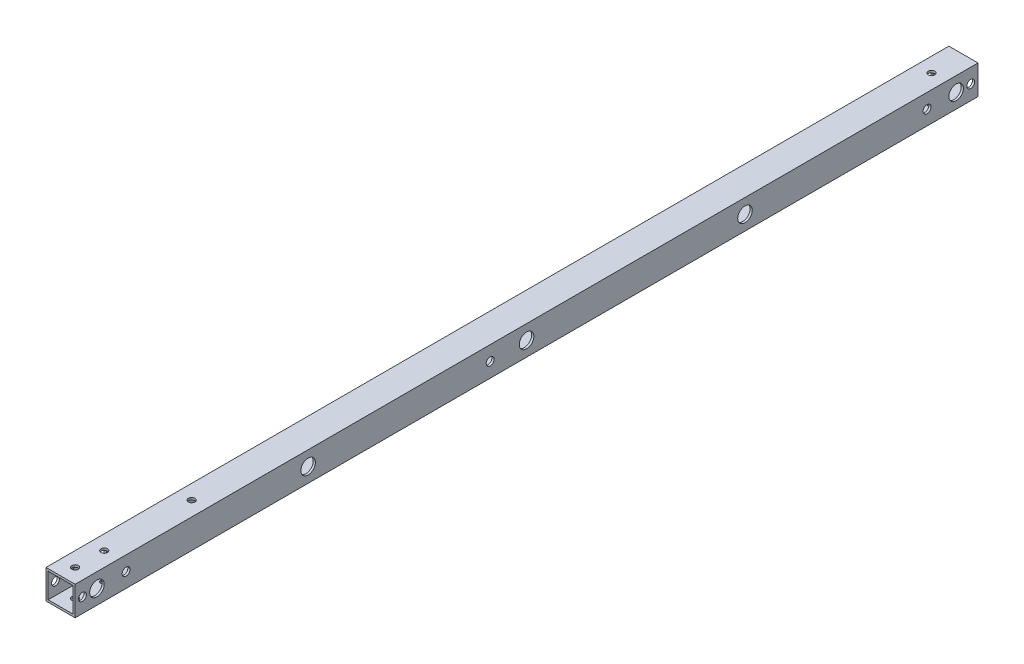
ISO-10303-21;
HEADER;
FILE_DESCRIPTION(('STEP AP214'),'2;1');
FILE_NAME('part.step','',(''),(''),'','','');
FILE_SCHEMA(('AUTOMOTIVE_DESIGN { 1 0 10303 214 1 1 1 1 }'));
ENDSEC;
DATA;
#1=APPLICATION_CONTEXT('core data for automotive mechanical design processes');
#2=APPLICATION_PROTOCOL_DEFINITION('international standard','automotive_design',2000,#1);
#3=PRODUCT_CONTEXT('',#1,'mechanical');
#4=PRODUCT('Part','Part','',(#3));
#5=PRODUCT_RELATED_PRODUCT_CATEGORY('part','',(#4));
#6=PRODUCT_DEFINITION_FORMATION('','',#4);
#7=PRODUCT_DEFINITION_CONTEXT('part definition',#1,'design');
#8=PRODUCT_DEFINITION('design','',#6,#7);
#9=PRODUCT_DEFINITION_SHAPE('','',#8);
#10=(LENGTH_UNIT() NAMED_UNIT(*) SI_UNIT(.MILLI.,.METRE.));
#11=(NAMED_UNIT(*) PLANE_ANGLE_UNIT() SI_UNIT($,.RADIAN.));
#12=(NAMED_UNIT(*) SI_UNIT($,.STERADIAN.) SOLID_ANGLE_UNIT());
#13=UNCERTAINTY_MEASURE_WITH_UNIT(LENGTH_MEASURE(1.E-05),#10,'distance_accuracy_value','');
#14=(GEOMETRIC_REPRESENTATION_CONTEXT(3) GLOBAL_UNCERTAINTY_ASSIGNED_CONTEXT((#13)) GLOBAL_UNIT_ASSIGNED_CONTEXT((#10,
#11,#12)) REPRESENTATION_CONTEXT('',''));
#15=CARTESIAN_POINT('',(0.,0.,0.));
#16=DIRECTION('',(0.,0.,1.));
#17=DIRECTION('',(1.,0.,0.));
#18=AXIS2_PLACEMENT_3D('',#15,#16,#17);
#19=CARTESIAN_POINT('',(0.,0.,620.));
#20=DIRECTION('',(0.,0.,-1.));
#21=DIRECTION('',(-1.,0.,0.));
#22=AXIS2_PLACEMENT_3D('',#19,#20,#21);
#23=PLANE('',#22);
#24=DIRECTION('',(0.,1.,0.));
#25=VECTOR('',#24,1.);
#26=CARTESIAN_POINT('',(10.,-10.,620.));
#27=LINE('',#26,#25);
#28=CARTESIAN_POINT('',(10.,-10.,620.));
#29=VERTEX_POINT('',#28);
#30=CARTESIAN_POINT('',(10.,10.,620.));
#31=VERTEX_POINT('',#30);
#32=EDGE_CURVE('E162',#29,#31,#27,.T.);
#33=ORIENTED_EDGE('',*,*,#32,.T.);
#34=DIRECTION('',(-1.,0.,0.));
#35=VECTOR('',#34,1.);
#36=CARTESIAN_POINT('',(-10.,10.,620.));
#37=LINE('',#36,#35);
#38=CARTESIAN_POINT('',(-10.,10.,620.));
#39=VERTEX_POINT('',#38);
#40=EDGE_CURVE('E166',#31,#39,#37,.T.);
#41=ORIENTED_EDGE('',*,*,#40,.T.);
#42=DIRECTION('',(0.,-1.,0.));
#43=VECTOR('',#42,1.);
#44=CARTESIAN_POINT('',(-10.,-10.,620.));
#45=LINE('',#44,#43);
#46=CARTESIAN_POINT('',(-10.,-10.,620.));
#47=VERTEX_POINT('',#46);
#48=EDGE_CURVE('E170',#39,#47,#45,.T.);
#49=ORIENTED_EDGE('',*,*,#48,.T.);
#50=DIRECTION('',(1.,0.,0.));
#51=VECTOR('',#50,1.);
#52=CARTESIAN_POINT('',(-10.,-10.,620.));
#53=LINE('',#52,#51);
#54=EDGE_CURVE('E173',#47,#29,#53,.T.);
#55=ORIENTED_EDGE('',*,*,#54,.T.);
#56=EDGE_LOOP('',(#33,#41,#49,#55));
#57=FACE_BOUND('',#56,.T.);
#58=DIRECTION('',(0.,1.,0.));
#59=VECTOR('',#58,1.);
#60=CARTESIAN_POINT('',(8.5,-8.5,620.));
#61=LINE('',#60,#59);
#62=CARTESIAN_POINT('',(8.5,-8.5,620.));
#63=VERTEX_POINT('',#62);
#64=CARTESIAN_POINT('',(8.5,8.5,620.));
#65=VERTEX_POINT('',#64);
#66=EDGE_CURVE('E111',#63,#65,#61,.T.);
#67=ORIENTED_EDGE('',*,*,#66,.F.);
#68=DIRECTION('',(1.,0.,0.));
#69=VECTOR('',#68,1.);
#70=CARTESIAN_POINT('',(-8.5,-8.5,620.));
#71=LINE('',#70,#69);
#72=CARTESIAN_POINT('',(-8.5,-8.5,620.));
#73=VERTEX_POINT('',#72);
#74=EDGE_CURVE('E138',#73,#63,#71,.T.);
#75=ORIENTED_EDGE('',*,*,#74,.F.);
#76=DIRECTION('',(0.,-1.,0.));
#77=VECTOR('',#76,1.);
#78=CARTESIAN_POINT('',(-8.5,-8.5,620.));
#79=LINE('',#78,#77);
#80=CARTESIAN_POINT('',(-8.5,8.5,620.));
#81=VERTEX_POINT('',#80);
#82=EDGE_CURVE('E133',#81,#73,#79,.T.);
#83=ORIENTED_EDGE('',*,*,#82,.F.);
#84=DIRECTION('',(-1.,0.,0.));
#85=VECTOR('',#84,1.);
#86=CARTESIAN_POINT('',(-8.5,8.5,620.));
#87=LINE('',#86,#85);
#88=EDGE_CURVE('E120',#65,#81,#87,.T.);
#89=ORIENTED_EDGE('',*,*,#88,.F.);
#90=EDGE_LOOP('',(#67,#75,#83,#89));
#91=FACE_BOUND('',#90,.T.);
#92=ADVANCED_FACE('F43',(#57,#91),#23,.F.);
#93=CARTESIAN_POINT('',(0.,0.,0.));
#94=DIRECTION('',(0.,0.,-1.));
#95=DIRECTION('',(-1.,0.,0.));
#96=AXIS2_PLACEMENT_3D('',#93,#94,#95);
#97=PLANE('',#96);
#98=DIRECTION('',(0.,1.,0.));
#99=VECTOR('',#98,1.);
#100=CARTESIAN_POINT('',(10.,-10.,0.));
#101=LINE('',#100,#99);
#102=CARTESIAN_POINT('',(10.,-10.,0.));
#103=VERTEX_POINT('',#102);
#104=CARTESIAN_POINT('',(10.,10.,0.));
#105=VERTEX_POINT('',#104);
#106=EDGE_CURVE('E129',#103,#105,#101,.T.);
#107=ORIENTED_EDGE('',*,*,#106,.F.);
#108=DIRECTION('',(1.,0.,0.));
#109=VECTOR('',#108,1.);
#110=CARTESIAN_POINT('',(-10.,-10.,0.));
#111=LINE('',#110,#109);
#112=CARTESIAN_POINT('',(-10.,-10.,0.));
#113=VERTEX_POINT('',#112);
#114=EDGE_CURVE('E167',#113,#103,#111,.T.);
#115=ORIENTED_EDGE('',*,*,#114,.F.);
#116=DIRECTION('',(0.,-1.,0.));
#117=VECTOR('',#116,1.);
#118=CARTESIAN_POINT('',(-10.,-10.,0.));
#119=LINE('',#118,#117);
#120=CARTESIAN_POINT('',(-10.,10.,0.));
#121=VERTEX_POINT('',#120);
#122=EDGE_CURVE('E183',#121,#113,#119,.T.);
#123=ORIENTED_EDGE('',*,*,#122,.F.);
#124=DIRECTION('',(-1.,0.,0.));
#125=VECTOR('',#124,1.);
#126=CARTESIAN_POINT('',(-10.,10.,0.));
#127=LINE('',#126,#125);
#128=EDGE_CURVE('E180',#105,#121,#127,.T.);
#129=ORIENTED_EDGE('',*,*,#128,.F.);
#130=EDGE_LOOP('',(#107,#115,#123,#129));
#131=FACE_BOUND('',#130,.T.);
#132=DIRECTION('',(1.,0.,0.));
#133=VECTOR('',#132,1.);
#134=CARTESIAN_POINT('',(-8.5,-8.5,0.));
#135=LINE('',#134,#133);
#136=CARTESIAN_POINT('',(-8.5,-8.5,0.));
#137=VERTEX_POINT('',#136);
#138=CARTESIAN_POINT('',(8.5,-8.5,0.));
#139=VERTEX_POINT('',#138);
#140=EDGE_CURVE('E121',#137,#139,#135,.T.);
#141=ORIENTED_EDGE('',*,*,#140,.T.);
#142=DIRECTION('',(0.,1.,0.));
#143=VECTOR('',#142,1.);
#144=CARTESIAN_POINT('',(8.5,-8.5,0.));
#145=LINE('',#144,#143);
#146=CARTESIAN_POINT('',(8.5,8.5,0.));
#147=VERTEX_POINT('',#146);
#148=EDGE_CURVE('E69',#139,#147,#145,.T.);
#149=ORIENTED_EDGE('',*,*,#148,.T.);
#150=DIRECTION('',(-1.,0.,0.));
#151=VECTOR('',#150,1.);
#152=CARTESIAN_POINT('',(-8.5,8.5,0.));
#153=LINE('',#152,#151);
#154=CARTESIAN_POINT('',(-8.5,8.5,0.));
#155=VERTEX_POINT('',#154);
#156=EDGE_CURVE('E127',#147,#155,#153,.T.);
#157=ORIENTED_EDGE('',*,*,#156,.T.);
#158=DIRECTION('',(0.,-1.,0.));
#159=VECTOR('',#158,1.);
#160=CARTESIAN_POINT('',(-8.5,-8.5,0.));
#161=LINE('',#160,#159);
#162=EDGE_CURVE('E149',#155,#137,#161,.T.);
#163=ORIENTED_EDGE('',*,*,#162,.T.);
#164=EDGE_LOOP('',(#141,#149,#157,#163));
#165=FACE_BOUND('',#164,.T.);
#166=ADVANCED_FACE('F393',(#131,#165),#97,.T.);
#167=CARTESIAN_POINT('',(10.,-10.,620.));
#168=DIRECTION('',(-1.,0.,0.));
#169=DIRECTION('',(0.,0.,1.));
#170=AXIS2_PLACEMENT_3D('',#167,#168,#169);
#171=PLANE('',#170);
#172=CARTESIAN_POINT('',(10.,0.,460.));
#173=DIRECTION('',(1.,0.,0.));
#174=DIRECTION('',(0.,0.,-1.));
#175=AXIS2_PLACEMENT_3D('',#172,#173,#174);
#176=CIRCLE('',#175,4.99999999999999);
#177=CARTESIAN_POINT('',(10.,0.,455.));
#178=VERTEX_POINT('',#177);
#179=EDGE_CURVE('E537',#178,#178,#176,.T.);
#180=ORIENTED_EDGE('',*,*,#179,.F.);
#181=EDGE_LOOP('',(#180));
#182=FACE_BOUND('',#181,.T.);
#183=CARTESIAN_POINT('',(10.,0.,310.));
#184=DIRECTION('',(1.,0.,0.));
#185=DIRECTION('',(0.,0.,-1.));
#186=AXIS2_PLACEMENT_3D('',#183,#184,#185);
#187=CIRCLE('',#186,4.99999999999999);
#188=CARTESIAN_POINT('',(10.,0.,305.));
#189=VERTEX_POINT('',#188);
#190=EDGE_CURVE('E542',#189,#189,#187,.T.);
#191=ORIENTED_EDGE('',*,*,#190,.F.);
#192=EDGE_LOOP('',(#191));
#193=FACE_BOUND('',#192,.T.);
#194=CARTESIAN_POINT('',(10.,0.,160.));
#195=DIRECTION('',(1.,0.,0.));
#196=DIRECTION('',(0.,0.,-1.));
#197=AXIS2_PLACEMENT_3D('',#194,#195,#196);
#198=CIRCLE('',#197,4.99999999999999);
#199=CARTESIAN_POINT('',(10.,0.,155.));
#200=VERTEX_POINT('',#199);
#201=EDGE_CURVE('E552',#200,#200,#198,.T.);
#202=ORIENTED_EDGE('',*,*,#201,.F.);
#203=EDGE_LOOP('',(#202));
#204=FACE_BOUND('',#203,.T.);
#205=CARTESIAN_POINT('',(10.,0.,605.));
#206=DIRECTION('',(1.,0.,0.));
#207=DIRECTION('',(0.,0.,-1.));
#208=AXIS2_PLACEMENT_3D('',#205,#206,#207);
#209=CIRCLE('',#208,5.00000000000004);
#210=CARTESIAN_POINT('',(10.,0.,600.));
#211=VERTEX_POINT('',#210);
#212=EDGE_CURVE('E261',#211,#211,#209,.T.);
#213=ORIENTED_EDGE('',*,*,#212,.F.);
#214=EDGE_LOOP('',(#213));
#215=FACE_BOUND('',#214,.T.);
#216=CARTESIAN_POINT('',(10.,0.,15.));
#217=DIRECTION('',(1.,0.,0.));
#218=DIRECTION('',(0.,0.,-1.));
#219=AXIS2_PLACEMENT_3D('',#216,#217,#218);
#220=CIRCLE('',#219,5.);
#221=CARTESIAN_POINT('',(10.,0.,10.));
#222=VERTEX_POINT('',#221);
#223=EDGE_CURVE('E583',#222,#222,#220,.T.);
#224=ORIENTED_EDGE('',*,*,#223,.F.);
#225=EDGE_LOOP('',(#224));
#226=FACE_BOUND('',#225,.T.);
#227=CARTESIAN_POINT('',(10.,0.,5.));
#228=DIRECTION('',(1.,0.,0.));
#229=DIRECTION('',(0.,0.,-1.));
#230=AXIS2_PLACEMENT_3D('',#227,#228,#229);
#231=CIRCLE('',#230,2.7);
#232=CARTESIAN_POINT('',(10.,0.,2.3));
#233=VERTEX_POINT('',#232);
#234=EDGE_CURVE('E221',#233,#233,#231,.T.);
#235=ORIENTED_EDGE('',*,*,#234,.F.);
#236=EDGE_LOOP('',(#235));
#237=FACE_BOUND('',#236,.T.);
#238=CARTESIAN_POINT('',(10.,0.,615.));
#239=DIRECTION('',(1.,0.,0.));
#240=DIRECTION('',(0.,0.,-1.));
#241=AXIS2_PLACEMENT_3D('',#238,#239,#240);
#242=CIRCLE('',#241,2.70000000000001);
#243=CARTESIAN_POINT('',(10.,0.,612.3));
#244=VERTEX_POINT('',#243);
#245=EDGE_CURVE('E242',#244,#244,#242,.T.);
#246=ORIENTED_EDGE('',*,*,#245,.F.);
#247=EDGE_LOOP('',(#246));
#248=FACE_BOUND('',#247,.T.);
#249=CARTESIAN_POINT('',(10.,0.,585.));
#250=DIRECTION('',(1.,0.,0.));
#251=DIRECTION('',(0.,0.,-1.));
#252=AXIS2_PLACEMENT_3D('',#249,#250,#251);
#253=CIRCLE('',#252,2.70000000000001);
#254=CARTESIAN_POINT('',(10.,0.,582.3));
#255=VERTEX_POINT('',#254);
#256=EDGE_CURVE('E347',#255,#255,#253,.T.);
#257=ORIENTED_EDGE('',*,*,#256,.F.);
#258=EDGE_LOOP('',(#257));
#259=FACE_BOUND('',#258,.T.);
#260=CARTESIAN_POINT('',(10.,0.,34.9999999999999));
#261=DIRECTION('',(1.,0.,0.));
#262=DIRECTION('',(0.,0.,-1.));
#263=AXIS2_PLACEMENT_3D('',#260,#261,#262);
#264=CIRCLE('',#263,2.7);
#265=CARTESIAN_POINT('',(10.,0.,32.2999999999999));
#266=VERTEX_POINT('',#265);
#267=EDGE_CURVE('E352',#266,#266,#264,.T.);
#268=ORIENTED_EDGE('',*,*,#267,.F.);
#269=EDGE_LOOP('',(#268));
#270=FACE_BOUND('',#269,.T.);
#271=CARTESIAN_POINT('',(10.,0.,335.));
#272=DIRECTION('',(1.,0.,0.));
#273=DIRECTION('',(0.,0.,-1.));
#274=AXIS2_PLACEMENT_3D('',#271,#272,#273);
#275=CIRCLE('',#274,2.69999999999996);
#276=CARTESIAN_POINT('',(10.,0.,332.3));
#277=VERTEX_POINT('',#276);
#278=EDGE_CURVE('E346',#277,#277,#275,.T.);
#279=ORIENTED_EDGE('',*,*,#278,.F.);
#280=EDGE_LOOP('',(#279));
#281=FACE_BOUND('',#280,.T.);
#282=ORIENTED_EDGE('',*,*,#106,.T.);
#283=DIRECTION('',(0.,0.,-1.));
#284=VECTOR('',#283,1.);
#285=CARTESIAN_POINT('',(10.,10.,620.));
#286=LINE('',#285,#284);
#287=EDGE_CURVE('E11',#31,#105,#286,.T.);
#288=ORIENTED_EDGE('',*,*,#287,.F.);
#289=ORIENTED_EDGE('',*,*,#32,.F.);
#290=DIRECTION('',(0.,0.,-1.));
#291=VECTOR('',#290,1.);
#292=CARTESIAN_POINT('',(10.,-10.,620.));
#293=LINE('',#292,#291);
#294=EDGE_CURVE('E176',#29,#103,#293,.T.);
#295=ORIENTED_EDGE('',*,*,#294,.T.);
#296=EDGE_LOOP('',(#282,#288,#289,#295));
#297=FACE_BOUND('',#296,.T.);
#298=ADVANCED_FACE('F45',(#182,#193,#204,#215,#226,#237,#248,#259,#270,#281,#297),#171,.F.);
#299=CARTESIAN_POINT('',(-10.,10.,620.));
#300=DIRECTION('',(0.,-1.,0.));
#301=DIRECTION('',(0.,0.,-1.));
#302=AXIS2_PLACEMENT_3D('',#299,#300,#301);
#303=PLANE('',#302);
#304=CARTESIAN_POINT('',(0.,10.,610.));
#305=DIRECTION('',(0.,1.,0.));
#306=DIRECTION('',(0.,0.,1.));
#307=AXIS2_PLACEMENT_3D('',#304,#305,#306);
#308=CIRCLE('',#307,2.24999999999998);
#309=CARTESIAN_POINT('',(0.,10.,612.25));
#310=VERTEX_POINT('',#309);
#311=EDGE_CURVE('E308',#310,#310,#308,.T.);
#312=ORIENTED_EDGE('',*,*,#311,.F.);
#313=EDGE_LOOP('',(#312));
#314=FACE_BOUND('',#313,.T.);
#315=CARTESIAN_POINT('',(0.,10.,590.));
#316=DIRECTION('',(0.,1.,0.));
#317=DIRECTION('',(0.,0.,1.));
#318=AXIS2_PLACEMENT_3D('',#315,#316,#317);
#319=CIRCLE('',#318,2.24999999999998);
#320=CARTESIAN_POINT('',(0.,10.,592.25));
#321=VERTEX_POINT('',#320);
#322=EDGE_CURVE('E314',#321,#321,#319,.T.);
#323=ORIENTED_EDGE('',*,*,#322,.F.);
#324=EDGE_LOOP('',(#323));
#325=FACE_BOUND('',#324,.T.);
#326=CARTESIAN_POINT('',(0.,10.,22.));
#327=DIRECTION('',(0.,1.,0.));
#328=DIRECTION('',(0.,0.,1.));
#329=AXIS2_PLACEMENT_3D('',#326,#327,#328);
#330=CIRCLE('',#329,2.25);
#331=CARTESIAN_POINT('',(0.,10.,24.25));
#332=VERTEX_POINT('',#331);
#333=EDGE_CURVE('E309',#332,#332,#330,.T.);
#334=ORIENTED_EDGE('',*,*,#333,.F.);
#335=EDGE_LOOP('',(#334));
#336=FACE_BOUND('',#335,.T.);
#337=CARTESIAN_POINT('',(-2.72685196434885E-13,10.,530.));
#338=DIRECTION('',(0.,1.,0.));
#339=DIRECTION('',(0.,0.,1.));
#340=AXIS2_PLACEMENT_3D('',#337,#338,#339);
#341=CIRCLE('',#340,2.24999999999998);
#342=CARTESIAN_POINT('',(-2.72685196434885E-13,10.,532.25));
#343=VERTEX_POINT('',#342);
#344=EDGE_CURVE('E313',#343,#343,#341,.T.);
#345=ORIENTED_EDGE('',*,*,#344,.F.);
#346=EDGE_LOOP('',(#345));
#347=FACE_BOUND('',#346,.T.);
#348=ORIENTED_EDGE('',*,*,#128,.T.);
#349=DIRECTION('',(0.,0.,-1.));
#350=VECTOR('',#349,1.);
#351=CARTESIAN_POINT('',(-10.,10.,620.));
#352=LINE('',#351,#350);
#353=EDGE_CURVE('E53',#39,#121,#352,.T.);
#354=ORIENTED_EDGE('',*,*,#353,.F.);
#355=ORIENTED_EDGE('',*,*,#40,.F.);
#356=ORIENTED_EDGE('',*,*,#287,.T.);
#357=EDGE_LOOP('',(#348,#354,#355,#356));
#358=FACE_BOUND('',#357,.T.);
#359=ADVANCED_FACE('F392',(#314,#325,#336,#347,#358),#303,.F.);
#360=CARTESIAN_POINT('',(-10.,-10.,620.));
#361=DIRECTION('',(1.,0.,0.));
#362=DIRECTION('',(0.,0.,-1.));
#363=AXIS2_PLACEMENT_3D('',#360,#361,#362);
#364=PLANE('',#363);
#365=CARTESIAN_POINT('',(-10.,0.,460.));
#366=DIRECTION('',(-1.,0.,0.));
#367=DIRECTION('',(0.,0.,1.));
#368=AXIS2_PLACEMENT_3D('',#365,#366,#367);
#369=CIRCLE('',#368,2.15);
#370=CARTESIAN_POINT('',(-10.,0.,462.15));
#371=VERTEX_POINT('',#370);
#372=EDGE_CURVE('E560',#371,#371,#369,.T.);
#373=ORIENTED_EDGE('',*,*,#372,.F.);
#374=EDGE_LOOP('',(#373));
#375=FACE_BOUND('',#374,.T.);
#376=CARTESIAN_POINT('',(-10.,0.,310.));
#377=DIRECTION('',(-1.,0.,0.));
#378=DIRECTION('',(0.,0.,1.));
#379=AXIS2_PLACEMENT_3D('',#376,#377,#378);
#380=CIRCLE('',#379,2.15);
#381=CARTESIAN_POINT('',(-10.,0.,312.15));
#382=VERTEX_POINT('',#381);
#383=EDGE_CURVE('E568',#382,#382,#380,.T.);
#384=ORIENTED_EDGE('',*,*,#383,.F.);
#385=EDGE_LOOP('',(#384));
#386=FACE_BOUND('',#385,.T.);
#387=CARTESIAN_POINT('',(-10.,0.,160.));
#388=DIRECTION('',(-1.,0.,0.));
#389=DIRECTION('',(0.,0.,1.));
#390=AXIS2_PLACEMENT_3D('',#387,#388,#389);
#391=CIRCLE('',#390,2.15);
#392=CARTESIAN_POINT('',(-10.,0.,162.15));
#393=VERTEX_POINT('',#392);
#394=EDGE_CURVE('E576',#393,#393,#391,.T.);
#395=ORIENTED_EDGE('',*,*,#394,.F.);
#396=EDGE_LOOP('',(#395));
#397=FACE_BOUND('',#396,.T.);
#398=CARTESIAN_POINT('',(-10.,0.,585.));
#399=DIRECTION('',(1.,0.,0.));
#400=DIRECTION('',(0.,0.,-1.));
#401=AXIS2_PLACEMENT_3D('',#398,#399,#400);
#402=CIRCLE('',#401,5.00000000000004);
#403=CARTESIAN_POINT('',(-10.,0.,580.));
#404=VERTEX_POINT('',#403);
#405=EDGE_CURVE('E249',#404,#404,#402,.T.);
#406=ORIENTED_EDGE('',*,*,#405,.T.);
#407=EDGE_LOOP('',(#406));
#408=FACE_BOUND('',#407,.T.);
#409=CARTESIAN_POINT('',(-10.,0.,335.));
#410=DIRECTION('',(1.,0.,0.));
#411=DIRECTION('',(0.,0.,-1.));
#412=AXIS2_PLACEMENT_3D('',#409,#410,#411);
#413=CIRCLE('',#412,4.99999999999999);
#414=CARTESIAN_POINT('',(-10.,0.,330.));
#415=VERTEX_POINT('',#414);
#416=EDGE_CURVE('E270',#415,#415,#413,.T.);
#417=ORIENTED_EDGE('',*,*,#416,.T.);
#418=EDGE_LOOP('',(#417));
#419=FACE_BOUND('',#418,.T.);
#420=CARTESIAN_POINT('',(-10.,0.,34.9999999999999));
#421=DIRECTION('',(1.,0.,0.));
#422=DIRECTION('',(0.,0.,-1.));
#423=AXIS2_PLACEMENT_3D('',#420,#421,#422);
#424=CIRCLE('',#423,5.);
#425=CARTESIAN_POINT('',(-10.,0.,29.9999999999999));
#426=VERTEX_POINT('',#425);
#427=EDGE_CURVE('E264',#426,#426,#424,.T.);
#428=ORIENTED_EDGE('',*,*,#427,.T.);
#429=EDGE_LOOP('',(#428));
#430=FACE_BOUND('',#429,.T.);
#431=CARTESIAN_POINT('',(-10.,0.,5.));
#432=DIRECTION('',(1.,0.,0.));
#433=DIRECTION('',(0.,0.,-1.));
#434=AXIS2_PLACEMENT_3D('',#431,#432,#433);
#435=CIRCLE('',#434,2.7);
#436=CARTESIAN_POINT('',(-10.,0.,2.3));
#437=VERTEX_POINT('',#436);
#438=EDGE_CURVE('E304',#437,#437,#435,.T.);
#439=ORIENTED_EDGE('',*,*,#438,.T.);
#440=EDGE_LOOP('',(#439));
#441=FACE_BOUND('',#440,.T.);
#442=CARTESIAN_POINT('',(-10.,0.,615.));
#443=DIRECTION('',(1.,0.,0.));
#444=DIRECTION('',(0.,0.,-1.));
#445=AXIS2_PLACEMENT_3D('',#442,#443,#444);
#446=CIRCLE('',#445,2.70000000000001);
#447=CARTESIAN_POINT('',(-10.,0.,612.3));
#448=VERTEX_POINT('',#447);
#449=EDGE_CURVE('E237',#448,#448,#446,.T.);
#450=ORIENTED_EDGE('',*,*,#449,.T.);
#451=EDGE_LOOP('',(#450));
#452=FACE_BOUND('',#451,.T.);
#453=CARTESIAN_POINT('',(-10.,0.,605.));
#454=DIRECTION('',(1.,0.,0.));
#455=DIRECTION('',(0.,0.,-1.));
#456=AXIS2_PLACEMENT_3D('',#453,#454,#455);
#457=CIRCLE('',#456,2.70000000000001);
#458=CARTESIAN_POINT('',(-10.,0.,602.3));
#459=VERTEX_POINT('',#458);
#460=EDGE_CURVE('E226',#459,#459,#457,.T.);
#461=ORIENTED_EDGE('',*,*,#460,.T.);
#462=EDGE_LOOP('',(#461));
#463=FACE_BOUND('',#462,.T.);
#464=CARTESIAN_POINT('',(-10.,0.,15.));
#465=DIRECTION('',(1.,0.,0.));
#466=DIRECTION('',(0.,0.,-1.));
#467=AXIS2_PLACEMENT_3D('',#464,#465,#466);
#468=CIRCLE('',#467,2.7);
#469=CARTESIAN_POINT('',(-10.,0.,12.3));
#470=VERTEX_POINT('',#469);
#471=EDGE_CURVE('E220',#470,#470,#468,.T.);
#472=ORIENTED_EDGE('',*,*,#471,.T.);
#473=EDGE_LOOP('',(#472));
#474=FACE_BOUND('',#473,.T.);
#475=ORIENTED_EDGE('',*,*,#122,.T.);
#476=DIRECTION('',(0.,0.,-1.));
#477=VECTOR('',#476,1.);
#478=CARTESIAN_POINT('',(-10.,-10.,620.));
#479=LINE('',#478,#477);
#480=EDGE_CURVE('E191',#47,#113,#479,.T.);
#481=ORIENTED_EDGE('',*,*,#480,.F.);
#482=ORIENTED_EDGE('',*,*,#48,.F.);
#483=ORIENTED_EDGE('',*,*,#353,.T.);
#484=EDGE_LOOP('',(#475,#481,#482,#483));
#485=FACE_BOUND('',#484,.T.);
#486=ADVANCED_FACE('F411',(#375,#386,#397,#408,#419,#430,#441,#452,#463,#474,#485),#364,.F.);
#487=CARTESIAN_POINT('',(-10.,-10.,620.));
#488=DIRECTION('',(0.,1.,0.));
#489=DIRECTION('',(0.,0.,1.));
#490=AXIS2_PLACEMENT_3D('',#487,#488,#489);
#491=PLANE('',#490);
#492=CARTESIAN_POINT('',(-2.72685196434885E-13,-10.,530.));
#493=DIRECTION('',(0.,-1.,0.));
#494=DIRECTION('',(0.,0.,-1.));
#495=AXIS2_PLACEMENT_3D('',#492,#493,#494);
#496=CIRCLE('',#495,5.);
#497=CARTESIAN_POINT('',(-2.72685196434885E-13,-10.,525.));
#498=VERTEX_POINT('',#497);
#499=EDGE_CURVE('E243',#498,#498,#496,.T.);
#500=ORIENTED_EDGE('',*,*,#499,.F.);
#501=EDGE_LOOP('',(#500));
#502=FACE_BOUND('',#501,.T.);
#503=CARTESIAN_POINT('',(0.,-10.,610.));
#504=DIRECTION('',(0.,1.,0.));
#505=DIRECTION('',(0.,0.,1.));
#506=AXIS2_PLACEMENT_3D('',#503,#504,#505);
#507=CIRCLE('',#506,2.24999999999998);
#508=CARTESIAN_POINT('',(0.,-10.,612.25));
#509=VERTEX_POINT('',#508);
#510=EDGE_CURVE('E342',#509,#509,#507,.T.);
#511=ORIENTED_EDGE('',*,*,#510,.T.);
#512=EDGE_LOOP('',(#511));
#513=FACE_BOUND('',#512,.T.);
#514=CARTESIAN_POINT('',(0.,-10.,590.));
#515=DIRECTION('',(0.,1.,0.));
#516=DIRECTION('',(0.,0.,1.));
#517=AXIS2_PLACEMENT_3D('',#514,#515,#516);
#518=CIRCLE('',#517,2.24999999999998);
#519=CARTESIAN_POINT('',(0.,-10.,592.25));
#520=VERTEX_POINT('',#519);
#521=EDGE_CURVE('E215',#520,#520,#518,.T.);
#522=ORIENTED_EDGE('',*,*,#521,.T.);
#523=EDGE_LOOP('',(#522));
#524=FACE_BOUND('',#523,.T.);
#525=CARTESIAN_POINT('',(0.,-10.,22.));
#526=DIRECTION('',(0.,1.,0.));
#527=DIRECTION('',(0.,0.,1.));
#528=AXIS2_PLACEMENT_3D('',#525,#526,#527);
#529=CIRCLE('',#528,2.25);
#530=CARTESIAN_POINT('',(0.,-10.,24.25));
#531=VERTEX_POINT('',#530);
#532=EDGE_CURVE('E209',#531,#531,#529,.T.);
#533=ORIENTED_EDGE('',*,*,#532,.T.);
#534=EDGE_LOOP('',(#533));
#535=FACE_BOUND('',#534,.T.);
#536=ORIENTED_EDGE('',*,*,#114,.T.);
#537=ORIENTED_EDGE('',*,*,#294,.F.);
#538=ORIENTED_EDGE('',*,*,#54,.F.);
#539=ORIENTED_EDGE('',*,*,#480,.T.);
#540=EDGE_LOOP('',(#536,#537,#538,#539));
#541=FACE_BOUND('',#540,.T.);
#542=ADVANCED_FACE('F375',(#502,#513,#524,#535,#541),#491,.F.);
#543=CARTESIAN_POINT('',(8.5,-8.5,620.));
#544=DIRECTION('',(-1.,0.,0.));
#545=DIRECTION('',(0.,0.,1.));
#546=AXIS2_PLACEMENT_3D('',#543,#544,#545);
#547=PLANE('',#546);
#548=CARTESIAN_POINT('',(8.5,0.,460.));
#549=DIRECTION('',(1.,0.,0.));
#550=DIRECTION('',(0.,0.,-1.));
#551=AXIS2_PLACEMENT_3D('',#548,#549,#550);
#552=CIRCLE('',#551,5.);
#553=CARTESIAN_POINT('',(8.5,0.,455.));
#554=VERTEX_POINT('',#553);
#555=EDGE_CURVE('E534',#554,#554,#552,.T.);
#556=ORIENTED_EDGE('',*,*,#555,.T.);
#557=EDGE_LOOP('',(#556));
#558=FACE_BOUND('',#557,.T.);
#559=CARTESIAN_POINT('',(8.5,0.,310.));
#560=DIRECTION('',(1.,0.,0.));
#561=DIRECTION('',(0.,0.,-1.));
#562=AXIS2_PLACEMENT_3D('',#559,#560,#561);
#563=CIRCLE('',#562,5.);
#564=CARTESIAN_POINT('',(8.5,0.,305.));
#565=VERTEX_POINT('',#564);
#566=EDGE_CURVE('E548',#565,#565,#563,.T.);
#567=ORIENTED_EDGE('',*,*,#566,.T.);
#568=EDGE_LOOP('',(#567));
#569=FACE_BOUND('',#568,.T.);
#570=CARTESIAN_POINT('',(8.5,0.,160.));
#571=DIRECTION('',(1.,0.,0.));
#572=DIRECTION('',(0.,0.,-1.));
#573=AXIS2_PLACEMENT_3D('',#570,#571,#572);
#574=CIRCLE('',#573,5.);
#575=CARTESIAN_POINT('',(8.5,0.,155.));
#576=VERTEX_POINT('',#575);
#577=EDGE_CURVE('E556',#576,#576,#574,.T.);
#578=ORIENTED_EDGE('',*,*,#577,.T.);
#579=EDGE_LOOP('',(#578));
#580=FACE_BOUND('',#579,.T.);
#581=CARTESIAN_POINT('',(8.5,0.,605.));
#582=DIRECTION('',(-1.,0.,0.));
#583=DIRECTION('',(0.,0.,1.));
#584=AXIS2_PLACEMENT_3D('',#581,#582,#583);
#585=CIRCLE('',#584,5.00000000000004);
#586=CARTESIAN_POINT('',(8.5,0.,610.));
#587=VERTEX_POINT('',#586);
#588=EDGE_CURVE('E260',#587,#587,#585,.T.);
#589=ORIENTED_EDGE('',*,*,#588,.F.);
#590=EDGE_LOOP('',(#589));
#591=FACE_BOUND('',#590,.T.);
#592=CARTESIAN_POINT('',(8.5,0.,15.));
#593=DIRECTION('',(-1.,0.,0.));
#594=DIRECTION('',(0.,0.,1.));
#595=AXIS2_PLACEMENT_3D('',#592,#593,#594);
#596=CIRCLE('',#595,5.);
#597=CARTESIAN_POINT('',(8.5,0.,20.));
#598=VERTEX_POINT('',#597);
#599=EDGE_CURVE('E257',#598,#598,#596,.T.);
#600=ORIENTED_EDGE('',*,*,#599,.F.);
#601=EDGE_LOOP('',(#600));
#602=FACE_BOUND('',#601,.T.);
#603=CARTESIAN_POINT('',(8.5,0.,5.));
#604=DIRECTION('',(-1.,0.,0.));
#605=DIRECTION('',(0.,0.,1.));
#606=AXIS2_PLACEMENT_3D('',#603,#604,#605);
#607=CIRCLE('',#606,2.7);
#608=CARTESIAN_POINT('',(8.5,0.,7.7));
#609=VERTEX_POINT('',#608);
#610=EDGE_CURVE('E236',#609,#609,#607,.T.);
#611=ORIENTED_EDGE('',*,*,#610,.F.);
#612=EDGE_LOOP('',(#611));
#613=FACE_BOUND('',#612,.T.);
#614=CARTESIAN_POINT('',(8.5,0.,615.));
#615=DIRECTION('',(-1.,0.,0.));
#616=DIRECTION('',(0.,0.,1.));
#617=AXIS2_PLACEMENT_3D('',#614,#615,#616);
#618=CIRCLE('',#617,2.70000000000001);
#619=CARTESIAN_POINT('',(8.5,0.,617.7));
#620=VERTEX_POINT('',#619);
#621=EDGE_CURVE('E231',#620,#620,#618,.T.);
#622=ORIENTED_EDGE('',*,*,#621,.F.);
#623=EDGE_LOOP('',(#622));
#624=FACE_BOUND('',#623,.T.);
#625=CARTESIAN_POINT('',(8.5,0.,585.));
#626=DIRECTION('',(-1.,0.,0.));
#627=DIRECTION('',(0.,0.,1.));
#628=AXIS2_PLACEMENT_3D('',#625,#626,#627);
#629=CIRCLE('',#628,2.70000000000001);
#630=CARTESIAN_POINT('',(8.5,0.,587.7));
#631=VERTEX_POINT('',#630);
#632=EDGE_CURVE('E146',#631,#631,#629,.T.);
#633=ORIENTED_EDGE('',*,*,#632,.F.);
#634=EDGE_LOOP('',(#633));
#635=FACE_BOUND('',#634,.T.);
#636=CARTESIAN_POINT('',(8.5,0.,34.9999999999999));
#637=DIRECTION('',(-1.,0.,0.));
#638=DIRECTION('',(0.,0.,1.));
#639=AXIS2_PLACEMENT_3D('',#636,#637,#638);
#640=CIRCLE('',#639,2.7);
#641=CARTESIAN_POINT('',(8.5,0.,37.6999999999999));
#642=VERTEX_POINT('',#641);
#643=EDGE_CURVE('E362',#642,#642,#640,.T.);
#644=ORIENTED_EDGE('',*,*,#643,.F.);
#645=EDGE_LOOP('',(#644));
#646=FACE_BOUND('',#645,.T.);
#647=CARTESIAN_POINT('',(8.5,0.,335.));
#648=DIRECTION('',(-1.,0.,0.));
#649=DIRECTION('',(0.,0.,1.));
#650=AXIS2_PLACEMENT_3D('',#647,#648,#649);
#651=CIRCLE('',#650,2.69999999999996);
#652=CARTESIAN_POINT('',(8.5,0.,337.7));
#653=VERTEX_POINT('',#652);
#654=EDGE_CURVE('E351',#653,#653,#651,.T.);
#655=ORIENTED_EDGE('',*,*,#654,.F.);
#656=EDGE_LOOP('',(#655));
#657=FACE_BOUND('',#656,.T.);
#658=ORIENTED_EDGE('',*,*,#148,.F.);
#659=DIRECTION('',(0.,0.,-1.));
#660=VECTOR('',#659,1.);
#661=CARTESIAN_POINT('',(8.5,-8.5,620.));
#662=LINE('',#661,#660);
#663=EDGE_CURVE('E115',#63,#139,#662,.T.);
#664=ORIENTED_EDGE('',*,*,#663,.F.);
#665=ORIENTED_EDGE('',*,*,#66,.T.);
#666=DIRECTION('',(0.,0.,-1.));
#667=VECTOR('',#666,1.);
#668=CARTESIAN_POINT('',(8.5,8.5,620.));
#669=LINE('',#668,#667);
#670=EDGE_CURVE('E114',#65,#147,#669,.T.);
#671=ORIENTED_EDGE('',*,*,#670,.T.);
#672=EDGE_LOOP('',(#658,#664,#665,#671));
#673=FACE_BOUND('',#672,.T.);
#674=ADVANCED_FACE('F113',(#558,#569,#580,#591,#602,#613,#624,#635,#646,#657,#673),#547,.T.);
#675=CARTESIAN_POINT('',(-8.5,8.5,620.));
#676=DIRECTION('',(0.,-1.,0.));
#677=DIRECTION('',(0.,0.,-1.));
#678=AXIS2_PLACEMENT_3D('',#675,#676,#677);
#679=PLANE('',#678);
#680=CARTESIAN_POINT('',(0.,8.5,610.));
#681=DIRECTION('',(0.,-1.,0.));
#682=DIRECTION('',(0.,0.,-1.));
#683=AXIS2_PLACEMENT_3D('',#680,#681,#682);
#684=CIRCLE('',#683,2.24999999999998);
#685=CARTESIAN_POINT('',(0.,8.5,607.75));
#686=VERTEX_POINT('',#685);
#687=EDGE_CURVE('E214',#686,#686,#684,.T.);
#688=ORIENTED_EDGE('',*,*,#687,.F.);
#689=EDGE_LOOP('',(#688));
#690=FACE_BOUND('',#689,.T.);
#691=CARTESIAN_POINT('',(0.,8.5,590.));
#692=DIRECTION('',(0.,-1.,0.));
#693=DIRECTION('',(0.,0.,-1.));
#694=AXIS2_PLACEMENT_3D('',#691,#692,#693);
#695=CIRCLE('',#694,2.24999999999998);
#696=CARTESIAN_POINT('',(0.,8.5,587.75));
#697=VERTEX_POINT('',#696);
#698=EDGE_CURVE('E208',#697,#697,#695,.T.);
#699=ORIENTED_EDGE('',*,*,#698,.F.);
#700=EDGE_LOOP('',(#699));
#701=FACE_BOUND('',#700,.T.);
#702=CARTESIAN_POINT('',(0.,8.5,22.));
#703=DIRECTION('',(0.,-1.,0.));
#704=DIRECTION('',(0.,0.,-1.));
#705=AXIS2_PLACEMENT_3D('',#702,#703,#704);
#706=CIRCLE('',#705,2.25);
#707=CARTESIAN_POINT('',(0.,8.5,19.75));
#708=VERTEX_POINT('',#707);
#709=EDGE_CURVE('E202',#708,#708,#706,.T.);
#710=ORIENTED_EDGE('',*,*,#709,.F.);
#711=EDGE_LOOP('',(#710));
#712=FACE_BOUND('',#711,.T.);
#713=CARTESIAN_POINT('',(-2.72685196434885E-13,8.5,530.));
#714=DIRECTION('',(0.,-1.,0.));
#715=DIRECTION('',(0.,0.,-1.));
#716=AXIS2_PLACEMENT_3D('',#713,#714,#715);
#717=CIRCLE('',#716,2.24999999999998);
#718=CARTESIAN_POINT('',(-2.72685196434885E-13,8.5,527.75));
#719=VERTEX_POINT('',#718);
#720=EDGE_CURVE('E203',#719,#719,#717,.T.);
#721=ORIENTED_EDGE('',*,*,#720,.F.);
#722=EDGE_LOOP('',(#721));
#723=FACE_BOUND('',#722,.T.);
#724=ORIENTED_EDGE('',*,*,#156,.F.);
#725=ORIENTED_EDGE('',*,*,#670,.F.);
#726=ORIENTED_EDGE('',*,*,#88,.T.);
#727=DIRECTION('',(0.,0.,-1.));
#728=VECTOR('',#727,1.);
#729=CARTESIAN_POINT('',(-8.5,8.5,620.));
#730=LINE('',#729,#728);
#731=EDGE_CURVE('E130',#81,#155,#730,.T.);
#732=ORIENTED_EDGE('',*,*,#731,.T.);
#733=EDGE_LOOP('',(#724,#725,#726,#732));
#734=FACE_BOUND('',#733,.T.);
#735=ADVANCED_FACE('F124',(#690,#701,#712,#723,#734),#679,.T.);
#736=CARTESIAN_POINT('',(-8.5,-8.5,620.));
#737=DIRECTION('',(1.,0.,0.));
#738=DIRECTION('',(0.,0.,-1.));
#739=AXIS2_PLACEMENT_3D('',#736,#737,#738);
#740=PLANE('',#739);
#741=CARTESIAN_POINT('',(-8.5,0.,460.));
#742=DIRECTION('',(1.,0.,0.));
#743=DIRECTION('',(0.,0.,-1.));
#744=AXIS2_PLACEMENT_3D('',#741,#742,#743);
#745=CIRCLE('',#744,2.15);
#746=CARTESIAN_POINT('',(-8.5,0.,457.85));
#747=VERTEX_POINT('',#746);
#748=EDGE_CURVE('E564',#747,#747,#745,.T.);
#749=ORIENTED_EDGE('',*,*,#748,.F.);
#750=EDGE_LOOP('',(#749));
#751=FACE_BOUND('',#750,.T.);
#752=CARTESIAN_POINT('',(-8.5,0.,310.));
#753=DIRECTION('',(1.,0.,0.));
#754=DIRECTION('',(0.,0.,-1.));
#755=AXIS2_PLACEMENT_3D('',#752,#753,#754);
#756=CIRCLE('',#755,2.15);
#757=CARTESIAN_POINT('',(-8.5,0.,307.85));
#758=VERTEX_POINT('',#757);
#759=EDGE_CURVE('E572',#758,#758,#756,.T.);
#760=ORIENTED_EDGE('',*,*,#759,.F.);
#761=EDGE_LOOP('',(#760));
#762=FACE_BOUND('',#761,.T.);
#763=CARTESIAN_POINT('',(-8.5,0.,160.));
#764=DIRECTION('',(1.,0.,0.));
#765=DIRECTION('',(0.,0.,-1.));
#766=AXIS2_PLACEMENT_3D('',#763,#764,#765);
#767=CIRCLE('',#766,2.15);
#768=CARTESIAN_POINT('',(-8.5,0.,157.85));
#769=VERTEX_POINT('',#768);
#770=EDGE_CURVE('E47',#769,#769,#767,.T.);
#771=ORIENTED_EDGE('',*,*,#770,.F.);
#772=EDGE_LOOP('',(#771));
#773=FACE_BOUND('',#772,.T.);
#774=CARTESIAN_POINT('',(-8.5,0.,585.));
#775=DIRECTION('',(1.,0.,0.));
#776=DIRECTION('',(0.,0.,-1.));
#777=AXIS2_PLACEMENT_3D('',#774,#775,#776);
#778=CIRCLE('',#777,5.00000000000004);
#779=CARTESIAN_POINT('',(-8.5,0.,580.));
#780=VERTEX_POINT('',#779);
#781=EDGE_CURVE('E253',#780,#780,#778,.F.);
#782=ORIENTED_EDGE('',*,*,#781,.T.);
#783=EDGE_LOOP('',(#782));
#784=FACE_BOUND('',#783,.T.);
#785=CARTESIAN_POINT('',(-8.5,0.,335.));
#786=DIRECTION('',(1.,0.,0.));
#787=DIRECTION('',(0.,0.,-1.));
#788=AXIS2_PLACEMENT_3D('',#785,#786,#787);
#789=CIRCLE('',#788,4.99999999999999);
#790=CARTESIAN_POINT('',(-8.5,0.,330.));
#791=VERTEX_POINT('',#790);
#792=EDGE_CURVE('E248',#791,#791,#789,.F.);
#793=ORIENTED_EDGE('',*,*,#792,.T.);
#794=EDGE_LOOP('',(#793));
#795=FACE_BOUND('',#794,.T.);
#796=CARTESIAN_POINT('',(-8.5,0.,34.9999999999999));
#797=DIRECTION('',(1.,0.,0.));
#798=DIRECTION('',(0.,0.,-1.));
#799=AXIS2_PLACEMENT_3D('',#796,#797,#798);
#800=CIRCLE('',#799,5.);
#801=CARTESIAN_POINT('',(-8.5,0.,29.9999999999999));
#802=VERTEX_POINT('',#801);
#803=EDGE_CURVE('E244',#802,#802,#800,.F.);
#804=ORIENTED_EDGE('',*,*,#803,.T.);
#805=EDGE_LOOP('',(#804));
#806=FACE_BOUND('',#805,.T.);
#807=CARTESIAN_POINT('',(-8.5,0.,5.));
#808=DIRECTION('',(1.,0.,0.));
#809=DIRECTION('',(0.,0.,-1.));
#810=AXIS2_PLACEMENT_3D('',#807,#808,#809);
#811=CIRCLE('',#810,2.7);
#812=CARTESIAN_POINT('',(-8.5,0.,2.3));
#813=VERTEX_POINT('',#812);
#814=EDGE_CURVE('E232',#813,#813,#811,.T.);
#815=ORIENTED_EDGE('',*,*,#814,.F.);
#816=EDGE_LOOP('',(#815));
#817=FACE_BOUND('',#816,.T.);
#818=CARTESIAN_POINT('',(-8.5,0.,615.));
#819=DIRECTION('',(1.,0.,0.));
#820=DIRECTION('',(0.,0.,-1.));
#821=AXIS2_PLACEMENT_3D('',#818,#819,#820);
#822=CIRCLE('',#821,2.70000000000001);
#823=CARTESIAN_POINT('',(-8.5,0.,612.3));
#824=VERTEX_POINT('',#823);
#825=EDGE_CURVE('E227',#824,#824,#822,.T.);
#826=ORIENTED_EDGE('',*,*,#825,.F.);
#827=EDGE_LOOP('',(#826));
#828=FACE_BOUND('',#827,.T.);
#829=CARTESIAN_POINT('',(-8.5,0.,605.));
#830=DIRECTION('',(1.,0.,0.));
#831=DIRECTION('',(0.,0.,-1.));
#832=AXIS2_PLACEMENT_3D('',#829,#830,#831);
#833=CIRCLE('',#832,2.70000000000001);
#834=CARTESIAN_POINT('',(-8.5,0.,602.3));
#835=VERTEX_POINT('',#834);
#836=EDGE_CURVE('E222',#835,#835,#833,.T.);
#837=ORIENTED_EDGE('',*,*,#836,.F.);
#838=EDGE_LOOP('',(#837));
#839=FACE_BOUND('',#838,.T.);
#840=CARTESIAN_POINT('',(-8.5,0.,15.));
#841=DIRECTION('',(1.,0.,0.));
#842=DIRECTION('',(0.,0.,-1.));
#843=AXIS2_PLACEMENT_3D('',#840,#841,#842);
#844=CIRCLE('',#843,2.7);
#845=CARTESIAN_POINT('',(-8.5,0.,12.3));
#846=VERTEX_POINT('',#845);
#847=EDGE_CURVE('E216',#846,#846,#844,.T.);
#848=ORIENTED_EDGE('',*,*,#847,.F.);
#849=EDGE_LOOP('',(#848));
#850=FACE_BOUND('',#849,.T.);
#851=ORIENTED_EDGE('',*,*,#162,.F.);
#852=ORIENTED_EDGE('',*,*,#731,.F.);
#853=ORIENTED_EDGE('',*,*,#82,.T.);
#854=DIRECTION('',(0.,0.,-1.));
#855=VECTOR('',#854,1.);
#856=CARTESIAN_POINT('',(-8.5,-8.5,620.));
#857=LINE('',#856,#855);
#858=EDGE_CURVE('E61',#73,#137,#857,.T.);
#859=ORIENTED_EDGE('',*,*,#858,.T.);
#860=EDGE_LOOP('',(#851,#852,#853,#859));
#861=FACE_BOUND('',#860,.T.);
#862=ADVANCED_FACE('F435',(#751,#762,#773,#784,#795,#806,#817,#828,#839,#850,#861),#740,.T.);
#863=CARTESIAN_POINT('',(-8.5,-8.5,620.));
#864=DIRECTION('',(0.,1.,0.));
#865=DIRECTION('',(0.,0.,1.));
#866=AXIS2_PLACEMENT_3D('',#863,#864,#865);
#867=PLANE('',#866);
#868=CARTESIAN_POINT('',(-2.72685196434885E-13,-8.5,530.));
#869=DIRECTION('',(0.,1.,0.));
#870=DIRECTION('',(0.,0.,1.));
#871=AXIS2_PLACEMENT_3D('',#868,#869,#870);
#872=CIRCLE('',#871,5.);
#873=CARTESIAN_POINT('',(-2.72685196434885E-13,-8.5,535.));
#874=VERTEX_POINT('',#873);
#875=EDGE_CURVE('E238',#874,#874,#872,.T.);
#876=ORIENTED_EDGE('',*,*,#875,.F.);
#877=EDGE_LOOP('',(#876));
#878=FACE_BOUND('',#877,.T.);
#879=CARTESIAN_POINT('',(0.,-8.5,610.));
#880=DIRECTION('',(0.,1.,0.));
#881=DIRECTION('',(0.,0.,1.));
#882=AXIS2_PLACEMENT_3D('',#879,#880,#881);
#883=CIRCLE('',#882,2.24999999999998);
#884=CARTESIAN_POINT('',(0.,-8.5,612.25));
#885=VERTEX_POINT('',#884);
#886=EDGE_CURVE('E210',#885,#885,#883,.T.);
#887=ORIENTED_EDGE('',*,*,#886,.F.);
#888=EDGE_LOOP('',(#887));
#889=FACE_BOUND('',#888,.T.);
#890=CARTESIAN_POINT('',(0.,-8.5,590.));
#891=DIRECTION('',(0.,1.,0.));
#892=DIRECTION('',(0.,0.,1.));
#893=AXIS2_PLACEMENT_3D('',#890,#891,#892);
#894=CIRCLE('',#893,2.24999999999998);
#895=CARTESIAN_POINT('',(0.,-8.5,592.25));
#896=VERTEX_POINT('',#895);
#897=EDGE_CURVE('E204',#896,#896,#894,.T.);
#898=ORIENTED_EDGE('',*,*,#897,.F.);
#899=EDGE_LOOP('',(#898));
#900=FACE_BOUND('',#899,.T.);
#901=CARTESIAN_POINT('',(0.,-8.5,22.));
#902=DIRECTION('',(0.,1.,0.));
#903=DIRECTION('',(0.,0.,1.));
#904=AXIS2_PLACEMENT_3D('',#901,#902,#903);
#905=CIRCLE('',#904,2.25);
#906=CARTESIAN_POINT('',(0.,-8.5,24.25));
#907=VERTEX_POINT('',#906);
#908=EDGE_CURVE('E198',#907,#907,#905,.T.);
#909=ORIENTED_EDGE('',*,*,#908,.F.);
#910=EDGE_LOOP('',(#909));
#911=FACE_BOUND('',#910,.T.);
#912=ORIENTED_EDGE('',*,*,#140,.F.);
#913=ORIENTED_EDGE('',*,*,#858,.F.);
#914=ORIENTED_EDGE('',*,*,#74,.T.);
#915=ORIENTED_EDGE('',*,*,#663,.T.);
#916=EDGE_LOOP('',(#912,#913,#914,#915));
#917=FACE_BOUND('',#916,.T.);
#918=ADVANCED_FACE('F386',(#878,#889,#900,#911,#917),#867,.T.);
#919=CARTESIAN_POINT('',(-15.,0.,335.));
#920=DIRECTION('',(1.,0.,0.));
#921=DIRECTION('',(0.,0.,-1.));
#922=AXIS2_PLACEMENT_3D('',#919,#920,#921);
#923=CYLINDRICAL_SURFACE('',#922,2.69999999999996);
#924=ORIENTED_EDGE('',*,*,#654,.T.);
#925=EDGE_LOOP('',(#924));
#926=FACE_BOUND('',#925,.T.);
#927=ORIENTED_EDGE('',*,*,#278,.T.);
#928=EDGE_LOOP('',(#927));
#929=FACE_BOUND('',#928,.T.);
#930=ADVANCED_FACE('F382',(#926,#929),#923,.F.);
#931=CARTESIAN_POINT('',(-15.,0.,34.9999999999999));
#932=DIRECTION('',(1.,0.,0.));
#933=DIRECTION('',(0.,0.,-1.));
#934=AXIS2_PLACEMENT_3D('',#931,#932,#933);
#935=CYLINDRICAL_SURFACE('',#934,2.7);
#936=ORIENTED_EDGE('',*,*,#643,.T.);
#937=EDGE_LOOP('',(#936));
#938=FACE_BOUND('',#937,.T.);
#939=ORIENTED_EDGE('',*,*,#267,.T.);
#940=EDGE_LOOP('',(#939));
#941=FACE_BOUND('',#940,.T.);
#942=ADVANCED_FACE('F385',(#938,#941),#935,.F.);
#943=CARTESIAN_POINT('',(-15.,0.,585.));
#944=DIRECTION('',(1.,0.,0.));
#945=DIRECTION('',(0.,0.,-1.));
#946=AXIS2_PLACEMENT_3D('',#943,#944,#945);
#947=CYLINDRICAL_SURFACE('',#946,2.70000000000001);
#948=ORIENTED_EDGE('',*,*,#632,.T.);
#949=EDGE_LOOP('',(#948));
#950=FACE_BOUND('',#949,.T.);
#951=ORIENTED_EDGE('',*,*,#256,.T.);
#952=EDGE_LOOP('',(#951));
#953=FACE_BOUND('',#952,.T.);
#954=ADVANCED_FACE('F370',(#950,#953),#947,.F.);
#955=CARTESIAN_POINT('',(0.,-15.,22.));
#956=DIRECTION('',(0.,1.,0.));
#957=DIRECTION('',(0.,0.,1.));
#958=AXIS2_PLACEMENT_3D('',#955,#956,#957);
#959=CYLINDRICAL_SURFACE('',#958,2.25);
#960=ORIENTED_EDGE('',*,*,#908,.T.);
#961=EDGE_LOOP('',(#960));
#962=FACE_BOUND('',#961,.T.);
#963=ORIENTED_EDGE('',*,*,#532,.F.);
#964=EDGE_LOOP('',(#963));
#965=FACE_BOUND('',#964,.T.);
#966=ADVANCED_FACE('F447',(#962,#965),#959,.F.);
#967=CARTESIAN_POINT('',(0.,-15.,590.));
#968=DIRECTION('',(0.,1.,0.));
#969=DIRECTION('',(0.,0.,1.));
#970=AXIS2_PLACEMENT_3D('',#967,#968,#969);
#971=CYLINDRICAL_SURFACE('',#970,2.24999999999998);
#972=ORIENTED_EDGE('',*,*,#897,.T.);
#973=EDGE_LOOP('',(#972));
#974=FACE_BOUND('',#973,.T.);
#975=ORIENTED_EDGE('',*,*,#521,.F.);
#976=EDGE_LOOP('',(#975));
#977=FACE_BOUND('',#976,.T.);
#978=ADVANCED_FACE('F456',(#974,#977),#971,.F.);
#979=CARTESIAN_POINT('',(0.,-15.,610.));
#980=DIRECTION('',(0.,1.,0.));
#981=DIRECTION('',(0.,0.,1.));
#982=AXIS2_PLACEMENT_3D('',#979,#980,#981);
#983=CYLINDRICAL_SURFACE('',#982,2.24999999999998);
#984=ORIENTED_EDGE('',*,*,#886,.T.);
#985=EDGE_LOOP('',(#984));
#986=FACE_BOUND('',#985,.T.);
#987=ORIENTED_EDGE('',*,*,#510,.F.);
#988=EDGE_LOOP('',(#987));
#989=FACE_BOUND('',#988,.T.);
#990=ADVANCED_FACE('F452',(#986,#989),#983,.F.);
#991=CARTESIAN_POINT('',(-2.72685196434885E-13,-15.,530.));
#992=DIRECTION('',(0.,1.,0.));
#993=DIRECTION('',(0.,0.,1.));
#994=AXIS2_PLACEMENT_3D('',#991,#992,#993);
#995=CYLINDRICAL_SURFACE('',#994,2.24999999999998);
#996=ORIENTED_EDGE('',*,*,#720,.T.);
#997=EDGE_LOOP('',(#996));
#998=FACE_BOUND('',#997,.T.);
#999=ORIENTED_EDGE('',*,*,#344,.T.);
#1000=EDGE_LOOP('',(#999));
#1001=FACE_BOUND('',#1000,.T.);
#1002=ADVANCED_FACE('F448',(#998,#1001),#995,.F.);
#1003=ORIENTED_EDGE('',*,*,#709,.T.);
#1004=EDGE_LOOP('',(#1003));
#1005=FACE_BOUND('',#1004,.T.);
#1006=ORIENTED_EDGE('',*,*,#333,.T.);
#1007=EDGE_LOOP('',(#1006));
#1008=FACE_BOUND('',#1007,.T.);
#1009=ADVANCED_FACE('F451',(#1005,#1008),#959,.F.);
#1010=ORIENTED_EDGE('',*,*,#698,.T.);
#1011=EDGE_LOOP('',(#1010));
#1012=FACE_BOUND('',#1011,.T.);
#1013=ORIENTED_EDGE('',*,*,#322,.T.);
#1014=EDGE_LOOP('',(#1013));
#1015=FACE_BOUND('',#1014,.T.);
#1016=ADVANCED_FACE('F462',(#1012,#1015),#971,.F.);
#1017=ORIENTED_EDGE('',*,*,#687,.T.);
#1018=EDGE_LOOP('',(#1017));
#1019=FACE_BOUND('',#1018,.T.);
#1020=ORIENTED_EDGE('',*,*,#311,.T.);
#1021=EDGE_LOOP('',(#1020));
#1022=FACE_BOUND('',#1021,.T.);
#1023=ADVANCED_FACE('F458',(#1019,#1022),#983,.F.);
#1024=CARTESIAN_POINT('',(-30.,0.,15.));
#1025=DIRECTION('',(1.,0.,0.));
#1026=DIRECTION('',(0.,0.,-1.));
#1027=AXIS2_PLACEMENT_3D('',#1024,#1025,#1026);
#1028=CYLINDRICAL_SURFACE('',#1027,2.7);
#1029=ORIENTED_EDGE('',*,*,#847,.T.);
#1030=EDGE_LOOP('',(#1029));
#1031=FACE_BOUND('',#1030,.T.);
#1032=ORIENTED_EDGE('',*,*,#471,.F.);
#1033=EDGE_LOOP('',(#1032));
#1034=FACE_BOUND('',#1033,.T.);
#1035=ADVANCED_FACE('F466',(#1031,#1034),#1028,.F.);
#1036=CARTESIAN_POINT('',(-30.,0.,605.));
#1037=DIRECTION('',(1.,0.,0.));
#1038=DIRECTION('',(0.,0.,-1.));
#1039=AXIS2_PLACEMENT_3D('',#1036,#1037,#1038);
#1040=CYLINDRICAL_SURFACE('',#1039,2.70000000000001);
#1041=ORIENTED_EDGE('',*,*,#836,.T.);
#1042=EDGE_LOOP('',(#1041));
#1043=FACE_BOUND('',#1042,.T.);
#1044=ORIENTED_EDGE('',*,*,#460,.F.);
#1045=EDGE_LOOP('',(#1044));
#1046=FACE_BOUND('',#1045,.T.);
#1047=ADVANCED_FACE('F469',(#1043,#1046),#1040,.F.);
#1048=CARTESIAN_POINT('',(-30.,0.,615.));
#1049=DIRECTION('',(1.,0.,0.));
#1050=DIRECTION('',(0.,0.,-1.));
#1051=AXIS2_PLACEMENT_3D('',#1048,#1049,#1050);
#1052=CYLINDRICAL_SURFACE('',#1051,2.70000000000001);
#1053=ORIENTED_EDGE('',*,*,#825,.T.);
#1054=EDGE_LOOP('',(#1053));
#1055=FACE_BOUND('',#1054,.T.);
#1056=ORIENTED_EDGE('',*,*,#449,.F.);
#1057=EDGE_LOOP('',(#1056));
#1058=FACE_BOUND('',#1057,.T.);
#1059=ADVANCED_FACE('F471',(#1055,#1058),#1052,.F.);
#1060=CARTESIAN_POINT('',(-30.,0.,5.));
#1061=DIRECTION('',(1.,0.,0.));
#1062=DIRECTION('',(0.,0.,-1.));
#1063=AXIS2_PLACEMENT_3D('',#1060,#1061,#1062);
#1064=CYLINDRICAL_SURFACE('',#1063,2.7);
#1065=ORIENTED_EDGE('',*,*,#814,.T.);
#1066=EDGE_LOOP('',(#1065));
#1067=FACE_BOUND('',#1066,.T.);
#1068=ORIENTED_EDGE('',*,*,#438,.F.);
#1069=EDGE_LOOP('',(#1068));
#1070=FACE_BOUND('',#1069,.T.);
#1071=ADVANCED_FACE('F474',(#1067,#1070),#1064,.F.);
#1072=ORIENTED_EDGE('',*,*,#621,.T.);
#1073=EDGE_LOOP('',(#1072));
#1074=FACE_BOUND('',#1073,.T.);
#1075=ORIENTED_EDGE('',*,*,#245,.T.);
#1076=EDGE_LOOP('',(#1075));
#1077=FACE_BOUND('',#1076,.T.);
#1078=ADVANCED_FACE('F476',(#1074,#1077),#1052,.F.);
#1079=ORIENTED_EDGE('',*,*,#610,.T.);
#1080=EDGE_LOOP('',(#1079));
#1081=FACE_BOUND('',#1080,.T.);
#1082=ORIENTED_EDGE('',*,*,#234,.T.);
#1083=EDGE_LOOP('',(#1082));
#1084=FACE_BOUND('',#1083,.T.);
#1085=ADVANCED_FACE('F480',(#1081,#1084),#1064,.F.);
#1086=CARTESIAN_POINT('',(-2.72685196434885E-13,0.,530.));
#1087=DIRECTION('',(0.,-1.,0.));
#1088=DIRECTION('',(0.,0.,-1.));
#1089=AXIS2_PLACEMENT_3D('',#1086,#1087,#1088);
#1090=CYLINDRICAL_SURFACE('',#1089,5.);
#1091=ORIENTED_EDGE('',*,*,#875,.T.);
#1092=EDGE_LOOP('',(#1091));
#1093=FACE_BOUND('',#1092,.T.);
#1094=ORIENTED_EDGE('',*,*,#499,.T.);
#1095=EDGE_LOOP('',(#1094));
#1096=FACE_BOUND('',#1095,.T.);
#1097=ADVANCED_FACE('F484',(#1093,#1096),#1090,.F.);
#1098=CARTESIAN_POINT('',(0.,0.,34.9999999999999));
#1099=DIRECTION('',(-1.,0.,0.));
#1100=DIRECTION('',(0.,0.,1.));
#1101=AXIS2_PLACEMENT_3D('',#1098,#1099,#1100);
#1102=CYLINDRICAL_SURFACE('',#1101,5.);
#1103=ORIENTED_EDGE('',*,*,#803,.F.);
#1104=EDGE_LOOP('',(#1103));
#1105=FACE_BOUND('',#1104,.T.);
#1106=ORIENTED_EDGE('',*,*,#427,.F.);
#1107=EDGE_LOOP('',(#1106));
#1108=FACE_BOUND('',#1107,.T.);
#1109=ADVANCED_FACE('F487',(#1105,#1108),#1102,.F.);
#1110=CARTESIAN_POINT('',(0.,0.,335.));
#1111=DIRECTION('',(-1.,0.,0.));
#1112=DIRECTION('',(0.,0.,1.));
#1113=AXIS2_PLACEMENT_3D('',#1110,#1111,#1112);
#1114=CYLINDRICAL_SURFACE('',#1113,4.99999999999999);
#1115=ORIENTED_EDGE('',*,*,#792,.F.);
#1116=EDGE_LOOP('',(#1115));
#1117=FACE_BOUND('',#1116,.T.);
#1118=ORIENTED_EDGE('',*,*,#416,.F.);
#1119=EDGE_LOOP('',(#1118));
#1120=FACE_BOUND('',#1119,.T.);
#1121=ADVANCED_FACE('F491',(#1117,#1120),#1114,.F.);
#1122=CARTESIAN_POINT('',(0.,0.,585.));
#1123=DIRECTION('',(-1.,0.,0.));
#1124=DIRECTION('',(0.,0.,1.));
#1125=AXIS2_PLACEMENT_3D('',#1122,#1123,#1124);
#1126=CYLINDRICAL_SURFACE('',#1125,5.00000000000004);
#1127=ORIENTED_EDGE('',*,*,#781,.F.);
#1128=EDGE_LOOP('',(#1127));
#1129=FACE_BOUND('',#1128,.T.);
#1130=ORIENTED_EDGE('',*,*,#405,.F.);
#1131=EDGE_LOOP('',(#1130));
#1132=FACE_BOUND('',#1131,.T.);
#1133=ADVANCED_FACE('F495',(#1129,#1132),#1126,.F.);
#1134=CARTESIAN_POINT('',(5.,0.,15.));
#1135=DIRECTION('',(1.,0.,0.));
#1136=DIRECTION('',(0.,0.,-1.));
#1137=AXIS2_PLACEMENT_3D('',#1134,#1135,#1136);
#1138=CYLINDRICAL_SURFACE('',#1137,5.);
#1139=ORIENTED_EDGE('',*,*,#599,.T.);
#1140=EDGE_LOOP('',(#1139));
#1141=FACE_BOUND('',#1140,.T.);
#1142=ORIENTED_EDGE('',*,*,#223,.T.);
#1143=EDGE_LOOP('',(#1142));
#1144=FACE_BOUND('',#1143,.T.);
#1145=ADVANCED_FACE('F499',(#1141,#1144),#1138,.F.);
#1146=CARTESIAN_POINT('',(5.,0.,605.));
#1147=DIRECTION('',(1.,0.,0.));
#1148=DIRECTION('',(0.,0.,-1.));
#1149=AXIS2_PLACEMENT_3D('',#1146,#1147,#1148);
#1150=CYLINDRICAL_SURFACE('',#1149,5.00000000000004);
#1151=ORIENTED_EDGE('',*,*,#588,.T.);
#1152=EDGE_LOOP('',(#1151));
#1153=FACE_BOUND('',#1152,.T.);
#1154=ORIENTED_EDGE('',*,*,#212,.T.);
#1155=EDGE_LOOP('',(#1154));
#1156=FACE_BOUND('',#1155,.T.);
#1157=ADVANCED_FACE('F503',(#1153,#1156),#1150,.F.);
#1158=CARTESIAN_POINT('',(-10.,0.,160.));
#1159=DIRECTION('',(-1.,0.,0.));
#1160=DIRECTION('',(0.,0.,1.));
#1161=AXIS2_PLACEMENT_3D('',#1158,#1159,#1160);
#1162=CYLINDRICAL_SURFACE('',#1161,2.15);
#1163=ORIENTED_EDGE('',*,*,#770,.T.);
#1164=EDGE_LOOP('',(#1163));
#1165=FACE_BOUND('',#1164,.T.);
#1166=ORIENTED_EDGE('',*,*,#394,.T.);
#1167=EDGE_LOOP('',(#1166));
#1168=FACE_BOUND('',#1167,.T.);
#1169=ADVANCED_FACE('F506',(#1165,#1168),#1162,.F.);
#1170=CARTESIAN_POINT('',(-10.,0.,310.));
#1171=DIRECTION('',(-1.,0.,0.));
#1172=DIRECTION('',(0.,0.,1.));
#1173=AXIS2_PLACEMENT_3D('',#1170,#1171,#1172);
#1174=CYLINDRICAL_SURFACE('',#1173,2.15);
#1175=ORIENTED_EDGE('',*,*,#759,.T.);
#1176=EDGE_LOOP('',(#1175));
#1177=FACE_BOUND('',#1176,.T.);
#1178=ORIENTED_EDGE('',*,*,#383,.T.);
#1179=EDGE_LOOP('',(#1178));
#1180=FACE_BOUND('',#1179,.T.);
#1181=ADVANCED_FACE('F509',(#1177,#1180),#1174,.F.);
#1182=CARTESIAN_POINT('',(-10.,0.,460.));
#1183=DIRECTION('',(-1.,0.,0.));
#1184=DIRECTION('',(0.,0.,1.));
#1185=AXIS2_PLACEMENT_3D('',#1182,#1183,#1184);
#1186=CYLINDRICAL_SURFACE('',#1185,2.15);
#1187=ORIENTED_EDGE('',*,*,#748,.T.);
#1188=EDGE_LOOP('',(#1187));
#1189=FACE_BOUND('',#1188,.T.);
#1190=ORIENTED_EDGE('',*,*,#372,.T.);
#1191=EDGE_LOOP('',(#1190));
#1192=FACE_BOUND('',#1191,.T.);
#1193=ADVANCED_FACE('F513',(#1189,#1192),#1186,.F.);
#1194=CARTESIAN_POINT('',(10.,0.,160.));
#1195=DIRECTION('',(1.,0.,0.));
#1196=DIRECTION('',(0.,0.,-1.));
#1197=AXIS2_PLACEMENT_3D('',#1194,#1195,#1196);
#1198=CYLINDRICAL_SURFACE('',#1197,4.99999999999999);
#1199=ORIENTED_EDGE('',*,*,#577,.F.);
#1200=EDGE_LOOP('',(#1199));
#1201=FACE_BOUND('',#1200,.T.);
#1202=ORIENTED_EDGE('',*,*,#201,.T.);
#1203=EDGE_LOOP('',(#1202));
#1204=FACE_BOUND('',#1203,.T.);
#1205=ADVANCED_FACE('F517',(#1201,#1204),#1198,.F.);
#1206=CARTESIAN_POINT('',(10.,0.,310.));
#1207=DIRECTION('',(1.,0.,0.));
#1208=DIRECTION('',(0.,0.,-1.));
#1209=AXIS2_PLACEMENT_3D('',#1206,#1207,#1208);
#1210=CYLINDRICAL_SURFACE('',#1209,4.99999999999999);
#1211=ORIENTED_EDGE('',*,*,#566,.F.);
#1212=EDGE_LOOP('',(#1211));
#1213=FACE_BOUND('',#1212,.T.);
#1214=ORIENTED_EDGE('',*,*,#190,.T.);
#1215=EDGE_LOOP('',(#1214));
#1216=FACE_BOUND('',#1215,.T.);
#1217=ADVANCED_FACE('F521',(#1213,#1216),#1210,.F.);
#1218=CARTESIAN_POINT('',(10.,0.,460.));
#1219=DIRECTION('',(1.,0.,0.));
#1220=DIRECTION('',(0.,0.,-1.));
#1221=AXIS2_PLACEMENT_3D('',#1218,#1219,#1220);
#1222=CYLINDRICAL_SURFACE('',#1221,4.99999999999999);
#1223=ORIENTED_EDGE('',*,*,#555,.F.);
#1224=EDGE_LOOP('',(#1223));
#1225=FACE_BOUND('',#1224,.T.);
#1226=ORIENTED_EDGE('',*,*,#179,.T.);
#1227=EDGE_LOOP('',(#1226));
#1228=FACE_BOUND('',#1227,.T.);
#1229=ADVANCED_FACE('F525',(#1225,#1228),#1222,.F.);
#1230=CLOSED_SHELL('',(#92,#166,#298,#359,#486,#542,#674,#735,#862,#918,#930,#942,#954,#966,
#978,#990,#1002,#1009,#1016,#1023,#1035,#1047,#1059,#1071,#1078,#1085,#1097,#1109,#1121,#1133,
#1145,#1157,#1169,#1181,#1193,#1205,#1217,#1229));
#1231=MANIFOLD_SOLID_BREP('B2',#1230);
#1232=ADVANCED_BREP_SHAPE_REPRESENTATION('',(#18,#1231),#14);
#1233=SHAPE_DEFINITION_REPRESENTATION(#9,#1232);
ENDSEC;
END-ISO-10303-21;
